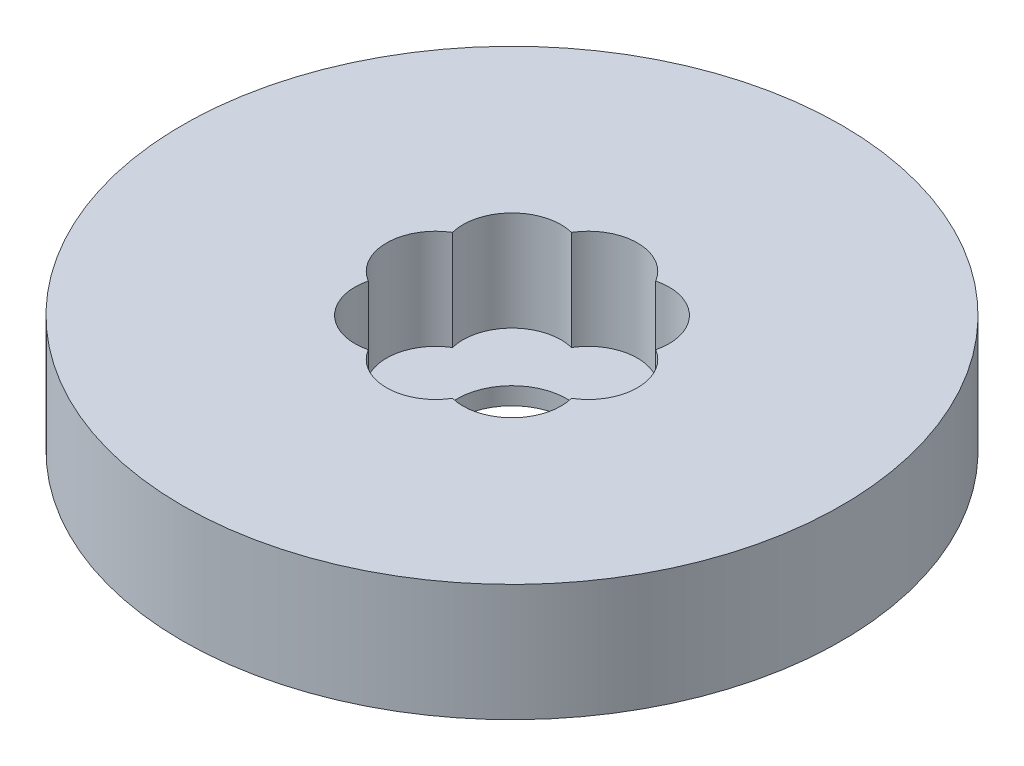
ISO-10303-21;
HEADER;
FILE_DESCRIPTION(('STEP AP214'),'2;1');
FILE_NAME('part.step','',(''),(''),'','','');
FILE_SCHEMA(('AUTOMOTIVE_DESIGN { 1 0 10303 214 1 1 1 1 }'));
ENDSEC;
DATA;
#1=APPLICATION_CONTEXT('core data for automotive mechanical design processes');
#2=APPLICATION_PROTOCOL_DEFINITION('international standard','automotive_design',2000,#1);
#3=PRODUCT_CONTEXT('',#1,'mechanical');
#4=PRODUCT('Part','Part','',(#3));
#5=PRODUCT_RELATED_PRODUCT_CATEGORY('part','',(#4));
#6=PRODUCT_DEFINITION_FORMATION('','',#4);
#7=PRODUCT_DEFINITION_CONTEXT('part definition',#1,'design');
#8=PRODUCT_DEFINITION('design','',#6,#7);
#9=PRODUCT_DEFINITION_SHAPE('','',#8);
#10=(LENGTH_UNIT() NAMED_UNIT(*) SI_UNIT(.MILLI.,.METRE.));
#11=(NAMED_UNIT(*) PLANE_ANGLE_UNIT() SI_UNIT($,.RADIAN.));
#12=(NAMED_UNIT(*) SI_UNIT($,.STERADIAN.) SOLID_ANGLE_UNIT());
#13=UNCERTAINTY_MEASURE_WITH_UNIT(LENGTH_MEASURE(1.E-05),#10,'distance_accuracy_value','');
#14=(GEOMETRIC_REPRESENTATION_CONTEXT(3) GLOBAL_UNCERTAINTY_ASSIGNED_CONTEXT((#13)) GLOBAL_UNIT_ASSIGNED_CONTEXT((#10,
#11,#12)) REPRESENTATION_CONTEXT('',''));
#15=CARTESIAN_POINT('',(0.,0.,0.));
#16=DIRECTION('',(0.,0.,1.));
#17=DIRECTION('',(1.,0.,0.));
#18=AXIS2_PLACEMENT_3D('',#15,#16,#17);
#19=CARTESIAN_POINT('',(0.,16.,0.));
#20=DIRECTION('',(0.,-1.,0.));
#21=DIRECTION('',(0.,0.,-1.));
#22=AXIS2_PLACEMENT_3D('',#19,#20,#21);
#23=CYLINDRICAL_SURFACE('',#22,7.5);
#24=CARTESIAN_POINT('',(0.,0.,0.));
#25=DIRECTION('',(0.,1.,0.));
#26=DIRECTION('',(0.,0.,1.));
#27=AXIS2_PLACEMENT_3D('',#24,#25,#26);
#28=CIRCLE('',#27,7.5);
#29=CARTESIAN_POINT('',(0.,0.,7.5));
#30=VERTEX_POINT('',#29);
#31=EDGE_CURVE('E166',#30,#30,#28,.T.);
#32=ORIENTED_EDGE('',*,*,#31,.F.);
#33=EDGE_LOOP('',(#32));
#34=FACE_BOUND('',#33,.T.);
#35=CARTESIAN_POINT('',(0.,2.38217464685192,0.));
#36=DIRECTION('',(0.,1.,0.));
#37=DIRECTION('',(0.,0.,1.));
#38=AXIS2_PLACEMENT_3D('',#35,#36,#37);
#39=CIRCLE('',#38,7.5);
#40=CARTESIAN_POINT('',(0.,2.38217464685192,7.5));
#41=VERTEX_POINT('',#40);
#42=EDGE_CURVE('E11',#41,#41,#39,.T.);
#43=ORIENTED_EDGE('',*,*,#42,.T.);
#44=EDGE_LOOP('',(#43));
#45=FACE_BOUND('',#44,.T.);
#46=ADVANCED_FACE('F39',(#34,#45),#23,.F.);
#47=CARTESIAN_POINT('',(0.,16.,0.));
#48=DIRECTION('',(0.,-1.,0.));
#49=DIRECTION('',(0.,0.,-1.));
#50=AXIS2_PLACEMENT_3D('',#47,#48,#49);
#51=CYLINDRICAL_SURFACE('',#50,45.);
#52=CARTESIAN_POINT('',(0.,16.,0.));
#53=DIRECTION('',(0.,1.,0.));
#54=DIRECTION('',(0.,0.,1.));
#55=AXIS2_PLACEMENT_3D('',#52,#53,#54);
#56=CIRCLE('',#55,45.);
#57=CARTESIAN_POINT('',(0.,16.,45.));
#58=VERTEX_POINT('',#57);
#59=EDGE_CURVE('E50',#58,#58,#56,.T.);
#60=ORIENTED_EDGE('',*,*,#59,.F.);
#61=EDGE_LOOP('',(#60));
#62=FACE_BOUND('',#61,.T.);
#63=CARTESIAN_POINT('',(0.,0.,0.));
#64=DIRECTION('',(0.,1.,0.));
#65=DIRECTION('',(0.,0.,1.));
#66=AXIS2_PLACEMENT_3D('',#63,#64,#65);
#67=CIRCLE('',#66,45.);
#68=CARTESIAN_POINT('',(0.,0.,45.));
#69=VERTEX_POINT('',#68);
#70=EDGE_CURVE('E173',#69,#69,#67,.T.);
#71=ORIENTED_EDGE('',*,*,#70,.T.);
#72=EDGE_LOOP('',(#71));
#73=FACE_BOUND('',#72,.T.);
#74=ADVANCED_FACE('F41',(#62,#73),#51,.T.);
#75=CARTESIAN_POINT('',(0.,16.,0.));
#76=DIRECTION('',(0.,1.,0.));
#77=DIRECTION('',(0.,0.,1.));
#78=AXIS2_PLACEMENT_3D('',#75,#76,#77);
#79=PLANE('',#78);
#80=CARTESIAN_POINT('',(-7.37578009542026,16.,7.37578009542029));
#81=DIRECTION('',(0.,1.,0.));
#82=DIRECTION('',(0.707106781186549,0.,0.707106781186546));
#83=AXIS2_PLACEMENT_3D('',#80,#81,#82);
#84=CIRCLE('',#83,6.70002090804905);
#85=CARTESIAN_POINT('',(-13.8748446744234,16.,5.74714883996628));
#86=VERTEX_POINT('',#85);
#87=CARTESIAN_POINT('',(-5.74714883996623,16.,13.8748446744234));
#88=VERTEX_POINT('',#87);
#89=EDGE_CURVE('E159',#86,#88,#84,.T.);
#90=ORIENTED_EDGE('',*,*,#89,.F.);
#91=CARTESIAN_POINT('',(-10.4309282440249,16.,0.));
#92=DIRECTION('',(0.,1.,0.));
#93=DIRECTION('',(0.,0.,1.));
#94=AXIS2_PLACEMENT_3D('',#91,#92,#93);
#95=CIRCLE('',#94,6.70002090804905);
#96=CARTESIAN_POINT('',(-13.8748446744235,16.,-5.74714883996621));
#97=VERTEX_POINT('',#96);
#98=EDGE_CURVE('E167',#97,#86,#95,.T.);
#99=ORIENTED_EDGE('',*,*,#98,.F.);
#100=CARTESIAN_POINT('',(-7.37578009542036,16.,-7.37578009542019));
#101=DIRECTION('',(0.,1.,0.));
#102=DIRECTION('',(-0.707106781186539,0.,0.707106781186556));
#103=AXIS2_PLACEMENT_3D('',#100,#101,#102);
#104=CIRCLE('',#103,6.70002090804905);
#105=CARTESIAN_POINT('',(-5.74714883996642,16.,-13.8748446744233));
#106=VERTEX_POINT('',#105);
#107=EDGE_CURVE('E53',#106,#97,#104,.T.);
#108=ORIENTED_EDGE('',*,*,#107,.F.);
#109=CARTESIAN_POINT('',(-1.09258173932474E-13,16.,-10.4309282440249));
#110=DIRECTION('',(0.,1.,0.));
#111=DIRECTION('',(-1.,0.,0.));
#112=AXIS2_PLACEMENT_3D('',#109,#110,#111);
#113=CIRCLE('',#112,6.70002090804905);
#114=CARTESIAN_POINT('',(5.74714883996614,16.,-13.8748446744234));
#115=VERTEX_POINT('',#114);
#116=EDGE_CURVE('E117',#115,#106,#113,.T.);
#117=ORIENTED_EDGE('',*,*,#116,.F.);
#118=CARTESIAN_POINT('',(7.37578009542021,16.,-7.37578009542034));
#119=DIRECTION('',(0.,1.,0.));
#120=DIRECTION('',(-0.707106781186554,0.,-0.707106781186541));
#121=AXIS2_PLACEMENT_3D('',#118,#119,#120);
#122=CIRCLE('',#121,6.70002090804905);
#123=CARTESIAN_POINT('',(13.8748446744233,16.,-5.74714883996631));
#124=VERTEX_POINT('',#123);
#125=EDGE_CURVE('E120',#124,#115,#122,.T.);
#126=ORIENTED_EDGE('',*,*,#125,.F.);
#127=CARTESIAN_POINT('',(10.4309282440249,16.,0.));
#128=DIRECTION('',(0.,1.,0.));
#129=DIRECTION('',(0.,0.,-1.));
#130=AXIS2_PLACEMENT_3D('',#127,#128,#129);
#131=CIRCLE('',#130,6.70002090804905);
#132=CARTESIAN_POINT('',(13.8748446744234,16.,5.74714883996624));
#133=VERTEX_POINT('',#132);
#134=EDGE_CURVE('E136',#133,#124,#131,.T.);
#135=ORIENTED_EDGE('',*,*,#134,.F.);
#136=CARTESIAN_POINT('',(7.37578009542031,16.,7.37578009542024));
#137=DIRECTION('',(0.,1.,0.));
#138=DIRECTION('',(0.707106781186544,0.,-0.707106781186551));
#139=AXIS2_PLACEMENT_3D('',#136,#137,#138);
#140=CIRCLE('',#139,6.70002090804905);
#141=CARTESIAN_POINT('',(5.74714883996633,16.,13.8748446744233));
#142=VERTEX_POINT('',#141);
#143=EDGE_CURVE('E138',#142,#133,#140,.T.);
#144=ORIENTED_EDGE('',*,*,#143,.F.);
#145=CARTESIAN_POINT('',(0.,16.,10.4309282440249));
#146=DIRECTION('',(0.,1.,0.));
#147=DIRECTION('',(1.,0.,0.));
#148=AXIS2_PLACEMENT_3D('',#145,#146,#147);
#149=CIRCLE('',#148,6.70002090804905);
#150=EDGE_CURVE('E146',#88,#142,#149,.T.);
#151=ORIENTED_EDGE('',*,*,#150,.F.);
#152=EDGE_LOOP('',(#90,#99,#108,#117,#126,#135,#144,#151));
#153=FACE_BOUND('',#152,.T.);
#154=ORIENTED_EDGE('',*,*,#59,.T.);
#155=EDGE_LOOP('',(#154));
#156=FACE_BOUND('',#155,.T.);
#157=ADVANCED_FACE('F181',(#153,#156),#79,.T.);
#158=CARTESIAN_POINT('',(0.,0.,0.));
#159=DIRECTION('',(0.,1.,0.));
#160=DIRECTION('',(0.,0.,1.));
#161=AXIS2_PLACEMENT_3D('',#158,#159,#160);
#162=PLANE('',#161);
#163=ORIENTED_EDGE('',*,*,#31,.T.);
#164=EDGE_LOOP('',(#163));
#165=FACE_BOUND('',#164,.T.);
#166=ORIENTED_EDGE('',*,*,#70,.F.);
#167=EDGE_LOOP('',(#166));
#168=FACE_BOUND('',#167,.T.);
#169=ADVANCED_FACE('F179',(#165,#168),#162,.F.);
#170=CARTESIAN_POINT('',(-10.4309282440249,2.38217464685192,0.));
#171=DIRECTION('',(0.,1.,0.));
#172=DIRECTION('',(0.,0.,1.));
#173=AXIS2_PLACEMENT_3D('',#170,#171,#172);
#174=CYLINDRICAL_SURFACE('',#173,6.70002090804905);
#175=ORIENTED_EDGE('',*,*,#98,.T.);
#176=DIRECTION('',(0.,1.,0.));
#177=VECTOR('',#176,1.);
#178=CARTESIAN_POINT('',(-13.8748446744234,9.19108732342596,5.74714883996628));
#179=LINE('',#178,#177);
#180=CARTESIAN_POINT('',(-13.8748446744234,2.38217464685192,5.74714883996628));
#181=VERTEX_POINT('',#180);
#182=EDGE_CURVE('E65',#86,#181,#179,.F.);
#183=ORIENTED_EDGE('',*,*,#182,.T.);
#184=CARTESIAN_POINT('',(-10.4309282440249,2.38217464685192,0.));
#185=DIRECTION('',(0.,1.,0.));
#186=DIRECTION('',(0.,0.,1.));
#187=AXIS2_PLACEMENT_3D('',#184,#185,#186);
#188=CIRCLE('',#187,6.70002090804905);
#189=CARTESIAN_POINT('',(-13.8748446744235,2.38217464685192,-5.74714883996621));
#190=VERTEX_POINT('',#189);
#191=EDGE_CURVE('E170',#190,#181,#188,.T.);
#192=ORIENTED_EDGE('',*,*,#191,.F.);
#193=DIRECTION('',(0.,1.,0.));
#194=VECTOR('',#193,1.);
#195=CARTESIAN_POINT('',(-13.8748446744235,9.19108732342596,-5.74714883996621));
#196=LINE('',#195,#194);
#197=EDGE_CURVE('E124',#190,#97,#196,.T.);
#198=ORIENTED_EDGE('',*,*,#197,.T.);
#199=EDGE_LOOP('',(#175,#183,#192,#198));
#200=FACE_BOUND('',#199,.T.);
#201=ADVANCED_FACE('F185',(#200),#174,.F.);
#202=CARTESIAN_POINT('',(-10.4309282440249,2.38217464685192,0.));
#203=DIRECTION('',(0.,1.,0.));
#204=DIRECTION('',(0.,0.,1.));
#205=AXIS2_PLACEMENT_3D('',#202,#203,#204);
#206=PLANE('',#205);
#207=ORIENTED_EDGE('',*,*,#191,.T.);
#208=CARTESIAN_POINT('',(-7.37578009542026,2.38217464685192,7.37578009542029));
#209=DIRECTION('',(0.,1.,0.));
#210=DIRECTION('',(0.707106781186549,0.,0.707106781186546));
#211=AXIS2_PLACEMENT_3D('',#208,#209,#210);
#212=CIRCLE('',#211,6.70002090804905);
#213=CARTESIAN_POINT('',(-5.74714883996623,2.38217464685192,13.8748446744234));
#214=VERTEX_POINT('',#213);
#215=EDGE_CURVE('E161',#181,#214,#212,.T.);
#216=ORIENTED_EDGE('',*,*,#215,.T.);
#217=CARTESIAN_POINT('',(0.,2.38217464685192,10.4309282440249));
#218=DIRECTION('',(0.,1.,0.));
#219=DIRECTION('',(1.,0.,0.));
#220=AXIS2_PLACEMENT_3D('',#217,#218,#219);
#221=CIRCLE('',#220,6.70002090804905);
#222=CARTESIAN_POINT('',(5.74714883996633,2.38217464685192,13.8748446744233));
#223=VERTEX_POINT('',#222);
#224=EDGE_CURVE('E149',#214,#223,#221,.T.);
#225=ORIENTED_EDGE('',*,*,#224,.T.);
#226=CARTESIAN_POINT('',(7.37578009542031,2.38217464685192,7.37578009542024));
#227=DIRECTION('',(0.,1.,0.));
#228=DIRECTION('',(0.707106781186544,0.,-0.707106781186551));
#229=AXIS2_PLACEMENT_3D('',#226,#227,#228);
#230=CIRCLE('',#229,6.70002090804905);
#231=CARTESIAN_POINT('',(13.8748446744234,2.38217464685192,5.74714883996625));
#232=VERTEX_POINT('',#231);
#233=EDGE_CURVE('E143',#223,#232,#230,.T.);
#234=ORIENTED_EDGE('',*,*,#233,.T.);
#235=CARTESIAN_POINT('',(10.4309282440249,2.38217464685192,0.));
#236=DIRECTION('',(0.,1.,0.));
#237=DIRECTION('',(0.,0.,-1.));
#238=AXIS2_PLACEMENT_3D('',#235,#236,#237);
#239=CIRCLE('',#238,6.70002090804905);
#240=CARTESIAN_POINT('',(13.8748446744233,2.38217464685192,-5.74714883996631));
#241=VERTEX_POINT('',#240);
#242=EDGE_CURVE('E140',#232,#241,#239,.T.);
#243=ORIENTED_EDGE('',*,*,#242,.T.);
#244=CARTESIAN_POINT('',(7.37578009542021,2.38217464685192,-7.37578009542034));
#245=DIRECTION('',(0.,1.,0.));
#246=DIRECTION('',(-0.707106781186554,0.,-0.707106781186541));
#247=AXIS2_PLACEMENT_3D('',#244,#245,#246);
#248=CIRCLE('',#247,6.70002090804905);
#249=CARTESIAN_POINT('',(5.74714883996614,2.38217464685192,-13.8748446744234));
#250=VERTEX_POINT('',#249);
#251=EDGE_CURVE('E111',#241,#250,#248,.T.);
#252=ORIENTED_EDGE('',*,*,#251,.T.);
#253=CARTESIAN_POINT('',(-1.09258173932474E-13,2.38217464685192,-10.4309282440249));
#254=DIRECTION('',(0.,1.,0.));
#255=DIRECTION('',(-1.,0.,0.));
#256=AXIS2_PLACEMENT_3D('',#253,#254,#255);
#257=CIRCLE('',#256,6.70002090804905);
#258=CARTESIAN_POINT('',(-5.74714883996642,2.38217464685192,-13.8748446744233));
#259=VERTEX_POINT('',#258);
#260=EDGE_CURVE('E104',#250,#259,#257,.T.);
#261=ORIENTED_EDGE('',*,*,#260,.T.);
#262=CARTESIAN_POINT('',(-7.37578009542036,2.38217464685192,-7.37578009542019));
#263=DIRECTION('',(0.,1.,0.));
#264=DIRECTION('',(-0.707106781186539,0.,0.707106781186556));
#265=AXIS2_PLACEMENT_3D('',#262,#263,#264);
#266=CIRCLE('',#265,6.70002090804905);
#267=EDGE_CURVE('E112',#259,#190,#266,.T.);
#268=ORIENTED_EDGE('',*,*,#267,.T.);
#269=EDGE_LOOP('',(#207,#216,#225,#234,#243,#252,#261,#268));
#270=FACE_BOUND('',#269,.T.);
#271=ORIENTED_EDGE('',*,*,#42,.F.);
#272=EDGE_LOOP('',(#271));
#273=FACE_BOUND('',#272,.T.);
#274=ADVANCED_FACE('F107',(#270,#273),#206,.T.);
#275=CARTESIAN_POINT('',(-7.37578009542026,2.38217464685192,7.37578009542029));
#276=DIRECTION('',(0.,1.,0.));
#277=DIRECTION('',(0.,0.,1.));
#278=AXIS2_PLACEMENT_3D('',#275,#276,#277);
#279=CYLINDRICAL_SURFACE('',#278,6.70002090804905);
#280=ORIENTED_EDGE('',*,*,#89,.T.);
#281=DIRECTION('',(0.,1.,0.));
#282=VECTOR('',#281,1.);
#283=CARTESIAN_POINT('',(-5.74714883996623,9.19108732342596,13.8748446744234));
#284=LINE('',#283,#282);
#285=EDGE_CURVE('E160',#88,#214,#284,.F.);
#286=ORIENTED_EDGE('',*,*,#285,.T.);
#287=ORIENTED_EDGE('',*,*,#215,.F.);
#288=ORIENTED_EDGE('',*,*,#182,.F.);
#289=EDGE_LOOP('',(#280,#286,#287,#288));
#290=FACE_BOUND('',#289,.T.);
#291=ADVANCED_FACE('F202',(#290),#279,.F.);
#292=CARTESIAN_POINT('',(-7.37578009542036,2.38217464685192,-7.37578009542019));
#293=DIRECTION('',(0.,1.,0.));
#294=DIRECTION('',(0.,0.,1.));
#295=AXIS2_PLACEMENT_3D('',#292,#293,#294);
#296=CYLINDRICAL_SURFACE('',#295,6.70002090804905);
#297=ORIENTED_EDGE('',*,*,#267,.F.);
#298=DIRECTION('',(0.,1.,0.));
#299=VECTOR('',#298,1.);
#300=CARTESIAN_POINT('',(-5.74714883996642,9.19108732342596,-13.8748446744233));
#301=LINE('',#300,#299);
#302=EDGE_CURVE('E119',#106,#259,#301,.F.);
#303=ORIENTED_EDGE('',*,*,#302,.F.);
#304=ORIENTED_EDGE('',*,*,#107,.T.);
#305=ORIENTED_EDGE('',*,*,#197,.F.);
#306=EDGE_LOOP('',(#297,#303,#304,#305));
#307=FACE_BOUND('',#306,.T.);
#308=ADVANCED_FACE('F123',(#307),#296,.F.);
#309=CARTESIAN_POINT('',(0.,2.38217464685192,10.4309282440249));
#310=DIRECTION('',(0.,1.,0.));
#311=DIRECTION('',(0.,0.,1.));
#312=AXIS2_PLACEMENT_3D('',#309,#310,#311);
#313=CYLINDRICAL_SURFACE('',#312,6.70002090804905);
#314=ORIENTED_EDGE('',*,*,#150,.T.);
#315=DIRECTION('',(0.,1.,0.));
#316=VECTOR('',#315,1.);
#317=CARTESIAN_POINT('',(5.74714883996633,9.19108732342596,13.8748446744233));
#318=LINE('',#317,#316);
#319=EDGE_CURVE('E141',#142,#223,#318,.F.);
#320=ORIENTED_EDGE('',*,*,#319,.T.);
#321=ORIENTED_EDGE('',*,*,#224,.F.);
#322=ORIENTED_EDGE('',*,*,#285,.F.);
#323=EDGE_LOOP('',(#314,#320,#321,#322));
#324=FACE_BOUND('',#323,.T.);
#325=ADVANCED_FACE('F208',(#324),#313,.F.);
#326=CARTESIAN_POINT('',(7.37578009542031,2.38217464685192,7.37578009542024));
#327=DIRECTION('',(0.,1.,0.));
#328=DIRECTION('',(0.,0.,1.));
#329=AXIS2_PLACEMENT_3D('',#326,#327,#328);
#330=CYLINDRICAL_SURFACE('',#329,6.70002090804905);
#331=DIRECTION('',(0.,1.,0.));
#332=VECTOR('',#331,1.);
#333=CARTESIAN_POINT('',(13.8748446744234,9.19108732342596,5.74714883996625));
#334=LINE('',#333,#332);
#335=EDGE_CURVE('E151',#133,#232,#334,.F.);
#336=ORIENTED_EDGE('',*,*,#335,.T.);
#337=ORIENTED_EDGE('',*,*,#233,.F.);
#338=ORIENTED_EDGE('',*,*,#319,.F.);
#339=ORIENTED_EDGE('',*,*,#143,.T.);
#340=EDGE_LOOP('',(#336,#337,#338,#339));
#341=FACE_BOUND('',#340,.T.);
#342=ADVANCED_FACE('F211',(#341),#330,.F.);
#343=CARTESIAN_POINT('',(10.4309282440249,2.38217464685192,0.));
#344=DIRECTION('',(0.,1.,0.));
#345=DIRECTION('',(0.,0.,1.));
#346=AXIS2_PLACEMENT_3D('',#343,#344,#345);
#347=CYLINDRICAL_SURFACE('',#346,6.70002090804905);
#348=ORIENTED_EDGE('',*,*,#134,.T.);
#349=DIRECTION('',(0.,1.,0.));
#350=VECTOR('',#349,1.);
#351=CARTESIAN_POINT('',(13.8748446744233,9.19108732342596,-5.74714883996631));
#352=LINE('',#351,#350);
#353=EDGE_CURVE('E131',#124,#241,#352,.F.);
#354=ORIENTED_EDGE('',*,*,#353,.T.);
#355=ORIENTED_EDGE('',*,*,#242,.F.);
#356=ORIENTED_EDGE('',*,*,#335,.F.);
#357=EDGE_LOOP('',(#348,#354,#355,#356));
#358=FACE_BOUND('',#357,.T.);
#359=ADVANCED_FACE('F214',(#358),#347,.F.);
#360=CARTESIAN_POINT('',(7.37578009542021,2.38217464685192,-7.37578009542034));
#361=DIRECTION('',(0.,1.,0.));
#362=DIRECTION('',(0.,0.,1.));
#363=AXIS2_PLACEMENT_3D('',#360,#361,#362);
#364=CYLINDRICAL_SURFACE('',#363,6.70002090804905);
#365=DIRECTION('',(0.,1.,0.));
#366=VECTOR('',#365,1.);
#367=CARTESIAN_POINT('',(5.74714883996614,9.19108732342596,-13.8748446744234));
#368=LINE('',#367,#366);
#369=EDGE_CURVE('E154',#115,#250,#368,.F.);
#370=ORIENTED_EDGE('',*,*,#369,.T.);
#371=ORIENTED_EDGE('',*,*,#251,.F.);
#372=ORIENTED_EDGE('',*,*,#353,.F.);
#373=ORIENTED_EDGE('',*,*,#125,.T.);
#374=EDGE_LOOP('',(#370,#371,#372,#373));
#375=FACE_BOUND('',#374,.T.);
#376=ADVANCED_FACE('F218',(#375),#364,.F.);
#377=CARTESIAN_POINT('',(-1.09258173932474E-13,2.38217464685192,-10.4309282440249));
#378=DIRECTION('',(0.,1.,0.));
#379=DIRECTION('',(0.,0.,1.));
#380=AXIS2_PLACEMENT_3D('',#377,#378,#379);
#381=CYLINDRICAL_SURFACE('',#380,6.70002090804905);
#382=ORIENTED_EDGE('',*,*,#116,.T.);
#383=ORIENTED_EDGE('',*,*,#302,.T.);
#384=ORIENTED_EDGE('',*,*,#260,.F.);
#385=ORIENTED_EDGE('',*,*,#369,.F.);
#386=EDGE_LOOP('',(#382,#383,#384,#385));
#387=FACE_BOUND('',#386,.T.);
#388=ADVANCED_FACE('F121',(#387),#381,.F.);
#389=CLOSED_SHELL('',(#46,#74,#157,#169,#201,#274,#291,#308,#325,#342,#359,#376,#388));
#390=MANIFOLD_SOLID_BREP('B2',#389);
#391=ADVANCED_BREP_SHAPE_REPRESENTATION('',(#18,#390),#14);
#392=SHAPE_DEFINITION_REPRESENTATION(#9,#391);
ENDSEC;
END-ISO-10303-21;
